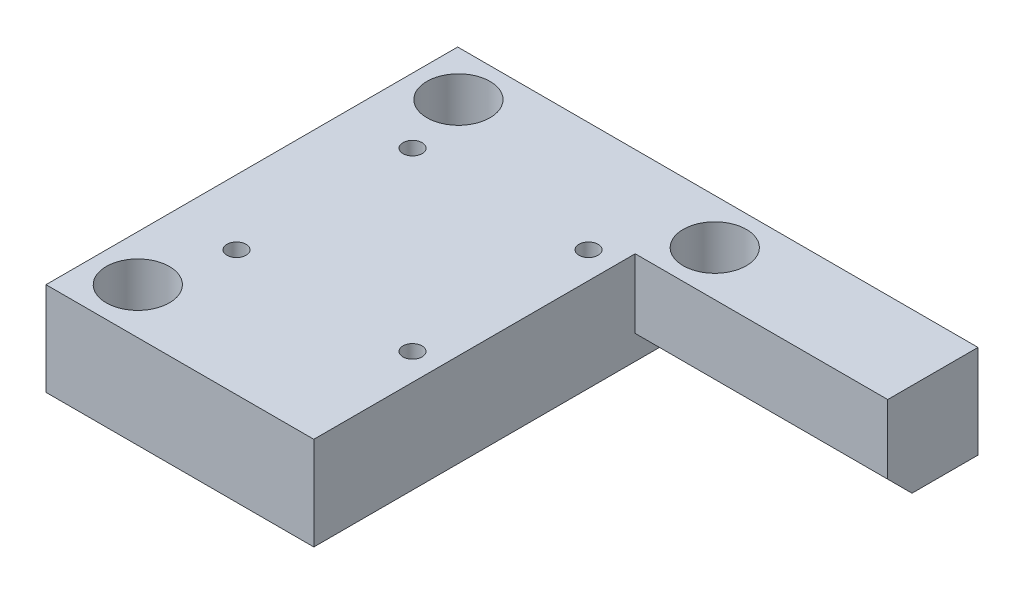
ISO-10303-21;
HEADER;
FILE_DESCRIPTION(('STEP AP214'),'2;1');
FILE_NAME('part.step','',(''),(''),'','','');
FILE_SCHEMA(('AUTOMOTIVE_DESIGN { 1 0 10303 214 1 1 1 1 }'));
ENDSEC;
DATA;
#1=APPLICATION_CONTEXT('core data for automotive mechanical design processes');
#2=APPLICATION_PROTOCOL_DEFINITION('international standard','automotive_design',2000,#1);
#3=PRODUCT_CONTEXT('',#1,'mechanical');
#4=PRODUCT('Part','Part','',(#3));
#5=PRODUCT_RELATED_PRODUCT_CATEGORY('part','',(#4));
#6=PRODUCT_DEFINITION_FORMATION('','',#4);
#7=PRODUCT_DEFINITION_CONTEXT('part definition',#1,'design');
#8=PRODUCT_DEFINITION('design','',#6,#7);
#9=PRODUCT_DEFINITION_SHAPE('','',#8);
#10=(LENGTH_UNIT() NAMED_UNIT(*) SI_UNIT(.MILLI.,.METRE.));
#11=(NAMED_UNIT(*) PLANE_ANGLE_UNIT() SI_UNIT($,.RADIAN.));
#12=(NAMED_UNIT(*) SI_UNIT($,.STERADIAN.) SOLID_ANGLE_UNIT());
#13=UNCERTAINTY_MEASURE_WITH_UNIT(LENGTH_MEASURE(1.E-05),#10,'distance_accuracy_value','');
#14=(GEOMETRIC_REPRESENTATION_CONTEXT(3) GLOBAL_UNCERTAINTY_ASSIGNED_CONTEXT((#13)) GLOBAL_UNIT_ASSIGNED_CONTEXT((#10,
#11,#12)) REPRESENTATION_CONTEXT('',''));
#15=CARTESIAN_POINT('',(0.,0.,0.));
#16=DIRECTION('',(0.,0.,1.));
#17=DIRECTION('',(1.,0.,0.));
#18=AXIS2_PLACEMENT_3D('',#15,#16,#17);
#19=CARTESIAN_POINT('',(0.,-12.192,11.8));
#20=DIRECTION('',(0.,1.,0.));
#21=DIRECTION('',(0.,0.,1.));
#22=AXIS2_PLACEMENT_3D('',#19,#20,#21);
#23=PLANE('',#22);
#24=CARTESIAN_POINT('',(6.,-12.192,47.8));
#25=DIRECTION('',(0.,1.,0.));
#26=DIRECTION('',(0.,0.,1.));
#27=AXIS2_PLACEMENT_3D('',#24,#25,#26);
#28=CIRCLE('',#27,2.25000000000002);
#29=CARTESIAN_POINT('',(6.,-12.192,50.05));
#30=VERTEX_POINT('',#29);
#31=EDGE_CURVE('E233',#30,#30,#28,.T.);
#32=ORIENTED_EDGE('',*,*,#31,.T.);
#33=EDGE_LOOP('',(#32));
#34=FACE_BOUND('',#33,.T.);
#35=CARTESIAN_POINT('',(6.,-12.192,5.90000000000001));
#36=DIRECTION('',(0.,1.,0.));
#37=DIRECTION('',(0.,0.,1.));
#38=AXIS2_PLACEMENT_3D('',#35,#36,#37);
#39=CIRCLE('',#38,2.25000000000002);
#40=CARTESIAN_POINT('',(6.,-12.192,8.15000000000003));
#41=VERTEX_POINT('',#40);
#42=EDGE_CURVE('E221',#41,#41,#39,.T.);
#43=ORIENTED_EDGE('',*,*,#42,.T.);
#44=EDGE_LOOP('',(#43));
#45=FACE_BOUND('',#44,.T.);
#46=CARTESIAN_POINT('',(39.5,-12.192,5.9));
#47=DIRECTION('',(0.,1.,0.));
#48=DIRECTION('',(0.,0.,1.));
#49=AXIS2_PLACEMENT_3D('',#46,#47,#48);
#50=CIRCLE('',#49,2.25000000000002);
#51=CARTESIAN_POINT('',(39.5,-12.192,8.15000000000002));
#52=VERTEX_POINT('',#51);
#53=EDGE_CURVE('E209',#52,#52,#50,.T.);
#54=ORIENTED_EDGE('',*,*,#53,.T.);
#55=EDGE_LOOP('',(#54));
#56=FACE_BOUND('',#55,.T.);
#57=CARTESIAN_POINT('',(31.5021834883644,-12.192,14.402424999977));
#58=DIRECTION('',(0.,-1.,0.));
#59=DIRECTION('',(0.,0.,-1.));
#60=AXIS2_PLACEMENT_3D('',#57,#58,#59);
#61=CIRCLE('',#60,1.24999999999369);
#62=CARTESIAN_POINT('',(31.5021834883644,-12.192,13.1524249999833));
#63=VERTEX_POINT('',#62);
#64=EDGE_CURVE('E206',#63,#63,#61,.T.);
#65=ORIENTED_EDGE('',*,*,#64,.F.);
#66=EDGE_LOOP('',(#65));
#67=FACE_BOUND('',#66,.T.);
#68=CARTESIAN_POINT('',(31.5000000000003,-12.192,37.4046084883411));
#69=DIRECTION('',(0.,-1.,0.));
#70=DIRECTION('',(0.,0.,-1.));
#71=AXIS2_PLACEMENT_3D('',#68,#69,#70);
#72=CIRCLE('',#71,1.24999999999369);
#73=CARTESIAN_POINT('',(31.5000000000003,-12.192,36.1546084883474));
#74=VERTEX_POINT('',#73);
#75=EDGE_CURVE('E200',#74,#74,#72,.T.);
#76=ORIENTED_EDGE('',*,*,#75,.F.);
#77=EDGE_LOOP('',(#76));
#78=FACE_BOUND('',#77,.T.);
#79=CARTESIAN_POINT('',(8.50000000000008,-12.192,14.4002415116128));
#80=DIRECTION('',(0.,-1.,0.));
#81=DIRECTION('',(0.,0.,-1.));
#82=AXIS2_PLACEMENT_3D('',#79,#80,#81);
#83=CIRCLE('',#82,1.24999999999369);
#84=CARTESIAN_POINT('',(8.50000000000008,-12.192,13.1502415116191));
#85=VERTEX_POINT('',#84);
#86=EDGE_CURVE('E188',#85,#85,#83,.T.);
#87=ORIENTED_EDGE('',*,*,#86,.F.);
#88=EDGE_LOOP('',(#87));
#89=FACE_BOUND('',#88,.T.);
#90=DIRECTION('',(0.,0.,1.));
#91=VECTOR('',#90,1.);
#92=CARTESIAN_POINT('',(68.,-12.192,11.8));
#93=LINE('',#92,#91);
#94=CARTESIAN_POINT('',(68.,-12.192,8.625));
#95=VERTEX_POINT('',#94);
#96=CARTESIAN_POINT('',(68.,-12.192,0.));
#97=VERTEX_POINT('',#96);
#98=EDGE_CURVE('E116',#95,#97,#93,.F.);
#99=ORIENTED_EDGE('',*,*,#98,.F.);
#100=DIRECTION('',(-1.,0.,0.));
#101=VECTOR('',#100,1.);
#102=CARTESIAN_POINT('',(35.,-12.192,8.625));
#103=LINE('',#102,#101);
#104=CARTESIAN_POINT('',(35.,-12.192,8.625));
#105=VERTEX_POINT('',#104);
#106=EDGE_CURVE('E47',#95,#105,#103,.T.);
#107=ORIENTED_EDGE('',*,*,#106,.T.);
#108=DIRECTION('',(0.,0.,1.));
#109=VECTOR('',#108,1.);
#110=CARTESIAN_POINT('',(35.,-12.192,11.8));
#111=LINE('',#110,#109);
#112=CARTESIAN_POINT('',(35.,-12.192,53.8));
#113=VERTEX_POINT('',#112);
#114=EDGE_CURVE('E53',#113,#105,#111,.F.);
#115=ORIENTED_EDGE('',*,*,#114,.F.);
#116=DIRECTION('',(1.,0.,0.));
#117=VECTOR('',#116,1.);
#118=CARTESIAN_POINT('',(0.,-12.192,53.8));
#119=LINE('',#118,#117);
#120=CARTESIAN_POINT('',(0.,-12.192,53.8));
#121=VERTEX_POINT('',#120);
#122=EDGE_CURVE('E111',#121,#113,#119,.T.);
#123=ORIENTED_EDGE('',*,*,#122,.F.);
#124=DIRECTION('',(0.,0.,1.));
#125=VECTOR('',#124,1.);
#126=CARTESIAN_POINT('',(0.,-12.192,11.8));
#127=LINE('',#126,#125);
#128=CARTESIAN_POINT('',(0.,-12.192,0.));
#129=VERTEX_POINT('',#128);
#130=EDGE_CURVE('E122',#129,#121,#127,.T.);
#131=ORIENTED_EDGE('',*,*,#130,.F.);
#132=DIRECTION('',(1.,0.,0.));
#133=VECTOR('',#132,1.);
#134=CARTESIAN_POINT('',(0.,-12.192,0.));
#135=LINE('',#134,#133);
#136=EDGE_CURVE('E126',#97,#129,#135,.F.);
#137=ORIENTED_EDGE('',*,*,#136,.F.);
#138=EDGE_LOOP('',(#99,#107,#115,#123,#131,#137));
#139=FACE_BOUND('',#138,.T.);
#140=CARTESIAN_POINT('',(8.497816511636,-12.192,37.4024249999771));
#141=DIRECTION('',(0.,-1.,0.));
#142=DIRECTION('',(0.,0.,-1.));
#143=AXIS2_PLACEMENT_3D('',#140,#141,#142);
#144=CIRCLE('',#143,1.24999999999369);
#145=CARTESIAN_POINT('',(8.497816511636,-12.192,36.1524249999834));
#146=VERTEX_POINT('',#145);
#147=EDGE_CURVE('E194',#146,#146,#144,.T.);
#148=ORIENTED_EDGE('',*,*,#147,.F.);
#149=EDGE_LOOP('',(#148));
#150=FACE_BOUND('',#149,.T.);
#151=ADVANCED_FACE('F39',(#34,#45,#56,#67,#78,#89,#139,#150),#23,.F.);
#152=CARTESIAN_POINT('',(0.,0.,11.8));
#153=DIRECTION('',(0.,-1.,0.));
#154=DIRECTION('',(0.,0.,-1.));
#155=AXIS2_PLACEMENT_3D('',#152,#153,#154);
#156=PLANE('',#155);
#157=CARTESIAN_POINT('',(6.,0.,47.8));
#158=DIRECTION('',(0.,1.,0.));
#159=DIRECTION('',(0.,0.,1.));
#160=AXIS2_PLACEMENT_3D('',#157,#158,#159);
#161=CIRCLE('',#160,4.125);
#162=CARTESIAN_POINT('',(6.,0.,51.925));
#163=VERTEX_POINT('',#162);
#164=EDGE_CURVE('E242',#163,#163,#161,.T.);
#165=ORIENTED_EDGE('',*,*,#164,.F.);
#166=EDGE_LOOP('',(#165));
#167=FACE_BOUND('',#166,.T.);
#168=CARTESIAN_POINT('',(6.,0.,5.90000000000001));
#169=DIRECTION('',(0.,1.,0.));
#170=DIRECTION('',(0.,0.,1.));
#171=AXIS2_PLACEMENT_3D('',#168,#169,#170);
#172=CIRCLE('',#171,4.125);
#173=CARTESIAN_POINT('',(6.,0.,10.025));
#174=VERTEX_POINT('',#173);
#175=EDGE_CURVE('E230',#174,#174,#172,.T.);
#176=ORIENTED_EDGE('',*,*,#175,.F.);
#177=EDGE_LOOP('',(#176));
#178=FACE_BOUND('',#177,.T.);
#179=CARTESIAN_POINT('',(39.5,0.,5.9));
#180=DIRECTION('',(0.,1.,0.));
#181=DIRECTION('',(0.,0.,1.));
#182=AXIS2_PLACEMENT_3D('',#179,#180,#181);
#183=CIRCLE('',#182,4.125);
#184=CARTESIAN_POINT('',(39.5,0.,10.025));
#185=VERTEX_POINT('',#184);
#186=EDGE_CURVE('E218',#185,#185,#183,.T.);
#187=ORIENTED_EDGE('',*,*,#186,.F.);
#188=EDGE_LOOP('',(#187));
#189=FACE_BOUND('',#188,.T.);
#190=CARTESIAN_POINT('',(31.5021834883644,0.,14.402424999977));
#191=DIRECTION('',(0.,-1.,0.));
#192=DIRECTION('',(0.,0.,-1.));
#193=AXIS2_PLACEMENT_3D('',#190,#191,#192);
#194=CIRCLE('',#193,1.24999999999369);
#195=CARTESIAN_POINT('',(31.5021834883644,0.,13.1524249999833));
#196=VERTEX_POINT('',#195);
#197=EDGE_CURVE('E203',#196,#196,#194,.T.);
#198=ORIENTED_EDGE('',*,*,#197,.T.);
#199=EDGE_LOOP('',(#198));
#200=FACE_BOUND('',#199,.T.);
#201=CARTESIAN_POINT('',(31.5000000000003,0.,37.4046084883411));
#202=DIRECTION('',(0.,-1.,0.));
#203=DIRECTION('',(0.,0.,-1.));
#204=AXIS2_PLACEMENT_3D('',#201,#202,#203);
#205=CIRCLE('',#204,1.24999999999369);
#206=CARTESIAN_POINT('',(31.5000000000003,0.,36.1546084883474));
#207=VERTEX_POINT('',#206);
#208=EDGE_CURVE('E197',#207,#207,#205,.T.);
#209=ORIENTED_EDGE('',*,*,#208,.T.);
#210=EDGE_LOOP('',(#209));
#211=FACE_BOUND('',#210,.T.);
#212=CARTESIAN_POINT('',(8.497816511636,0.,37.4024249999771));
#213=DIRECTION('',(0.,-1.,0.));
#214=DIRECTION('',(0.,0.,-1.));
#215=AXIS2_PLACEMENT_3D('',#212,#213,#214);
#216=CIRCLE('',#215,1.24999999999369);
#217=CARTESIAN_POINT('',(8.497816511636,0.,36.1524249999834));
#218=VERTEX_POINT('',#217);
#219=EDGE_CURVE('E191',#218,#218,#216,.T.);
#220=ORIENTED_EDGE('',*,*,#219,.T.);
#221=EDGE_LOOP('',(#220));
#222=FACE_BOUND('',#221,.T.);
#223=CARTESIAN_POINT('',(8.50000000000008,0.,14.4002415116128));
#224=DIRECTION('',(0.,-1.,0.));
#225=DIRECTION('',(0.,0.,-1.));
#226=AXIS2_PLACEMENT_3D('',#223,#224,#225);
#227=CIRCLE('',#226,1.24999999999369);
#228=CARTESIAN_POINT('',(8.50000000000008,0.,13.1502415116191));
#229=VERTEX_POINT('',#228);
#230=EDGE_CURVE('E173',#229,#229,#227,.T.);
#231=ORIENTED_EDGE('',*,*,#230,.T.);
#232=EDGE_LOOP('',(#231));
#233=FACE_BOUND('',#232,.T.);
#234=DIRECTION('',(0.,0.,1.));
#235=VECTOR('',#234,1.);
#236=CARTESIAN_POINT('',(0.,0.,11.8));
#237=LINE('',#236,#235);
#238=CARTESIAN_POINT('',(0.,0.,0.));
#239=VERTEX_POINT('',#238);
#240=CARTESIAN_POINT('',(0.,0.,53.8));
#241=VERTEX_POINT('',#240);
#242=EDGE_CURVE('E159',#239,#241,#237,.T.);
#243=ORIENTED_EDGE('',*,*,#242,.T.);
#244=DIRECTION('',(1.,0.,0.));
#245=VECTOR('',#244,1.);
#246=CARTESIAN_POINT('',(0.,0.,53.8));
#247=LINE('',#246,#245);
#248=CARTESIAN_POINT('',(35.,0.,53.8));
#249=VERTEX_POINT('',#248);
#250=EDGE_CURVE('E105',#249,#241,#247,.F.);
#251=ORIENTED_EDGE('',*,*,#250,.F.);
#252=DIRECTION('',(0.,0.,1.));
#253=VECTOR('',#252,1.);
#254=CARTESIAN_POINT('',(35.,0.,53.8));
#255=LINE('',#254,#253);
#256=CARTESIAN_POINT('',(35.,0.,11.8));
#257=VERTEX_POINT('',#256);
#258=EDGE_CURVE('E100',#249,#257,#255,.F.);
#259=ORIENTED_EDGE('',*,*,#258,.T.);
#260=DIRECTION('',(1.,0.,0.));
#261=VECTOR('',#260,1.);
#262=CARTESIAN_POINT('',(0.,0.,11.8));
#263=LINE('',#262,#261);
#264=CARTESIAN_POINT('',(68.,0.,11.8));
#265=VERTEX_POINT('',#264);
#266=EDGE_CURVE('E170',#265,#257,#263,.F.);
#267=ORIENTED_EDGE('',*,*,#266,.F.);
#268=DIRECTION('',(0.,0.,1.));
#269=VECTOR('',#268,1.);
#270=CARTESIAN_POINT('',(68.,0.,11.8));
#271=LINE('',#270,#269);
#272=CARTESIAN_POINT('',(68.,0.,0.));
#273=VERTEX_POINT('',#272);
#274=EDGE_CURVE('E292',#265,#273,#271,.F.);
#275=ORIENTED_EDGE('',*,*,#274,.T.);
#276=DIRECTION('',(1.,0.,0.));
#277=VECTOR('',#276,1.);
#278=CARTESIAN_POINT('',(0.,0.,0.));
#279=LINE('',#278,#277);
#280=EDGE_CURVE('E165',#273,#239,#279,.F.);
#281=ORIENTED_EDGE('',*,*,#280,.T.);
#282=EDGE_LOOP('',(#243,#251,#259,#267,#275,#281));
#283=FACE_BOUND('',#282,.T.);
#284=ADVANCED_FACE('F248',(#167,#178,#189,#200,#211,#222,#233,#283),#156,.F.);
#285=CARTESIAN_POINT('',(0.,0.,11.8));
#286=DIRECTION('',(0.,0.,1.));
#287=DIRECTION('',(1.,0.,0.));
#288=AXIS2_PLACEMENT_3D('',#285,#286,#287);
#289=PLANE('',#288);
#290=DIRECTION('',(0.,1.,0.));
#291=VECTOR('',#290,1.);
#292=CARTESIAN_POINT('',(35.,0.,11.8));
#293=LINE('',#292,#291);
#294=CARTESIAN_POINT('',(35.,-9.01700000000001,11.8));
#295=VERTEX_POINT('',#294);
#296=EDGE_CURVE('E294',#257,#295,#293,.F.);
#297=ORIENTED_EDGE('',*,*,#296,.T.);
#298=DIRECTION('',(1.,0.,0.));
#299=VECTOR('',#298,1.);
#300=CARTESIAN_POINT('',(68.,-9.01700000000001,11.8));
#301=LINE('',#300,#299);
#302=CARTESIAN_POINT('',(68.,-9.01700000000001,11.8));
#303=VERTEX_POINT('',#302);
#304=EDGE_CURVE('E174',#295,#303,#301,.T.);
#305=ORIENTED_EDGE('',*,*,#304,.T.);
#306=DIRECTION('',(0.,1.,0.));
#307=VECTOR('',#306,1.);
#308=CARTESIAN_POINT('',(68.,0.,11.8));
#309=LINE('',#308,#307);
#310=EDGE_CURVE('E278',#303,#265,#309,.T.);
#311=ORIENTED_EDGE('',*,*,#310,.T.);
#312=ORIENTED_EDGE('',*,*,#266,.T.);
#313=EDGE_LOOP('',(#297,#305,#311,#312));
#314=FACE_BOUND('',#313,.T.);
#315=ADVANCED_FACE('F251',(#314),#289,.T.);
#316=CARTESIAN_POINT('',(0.,0.,0.));
#317=DIRECTION('',(0.,0.,1.));
#318=DIRECTION('',(1.,0.,0.));
#319=AXIS2_PLACEMENT_3D('',#316,#317,#318);
#320=PLANE('',#319);
#321=ORIENTED_EDGE('',*,*,#280,.F.);
#322=DIRECTION('',(0.,1.,0.));
#323=VECTOR('',#322,1.);
#324=CARTESIAN_POINT('',(68.,0.,0.));
#325=LINE('',#324,#323);
#326=EDGE_CURVE('E281',#273,#97,#325,.F.);
#327=ORIENTED_EDGE('',*,*,#326,.T.);
#328=ORIENTED_EDGE('',*,*,#136,.T.);
#329=DIRECTION('',(0.,1.,0.));
#330=VECTOR('',#329,1.);
#331=CARTESIAN_POINT('',(0.,0.,0.));
#332=LINE('',#331,#330);
#333=EDGE_CURVE('E164',#129,#239,#332,.T.);
#334=ORIENTED_EDGE('',*,*,#333,.T.);
#335=EDGE_LOOP('',(#321,#327,#328,#334));
#336=FACE_BOUND('',#335,.T.);
#337=ADVANCED_FACE('F331',(#336),#320,.F.);
#338=CARTESIAN_POINT('',(0.,0.,11.8));
#339=DIRECTION('',(1.,0.,0.));
#340=DIRECTION('',(0.,1.,0.));
#341=AXIS2_PLACEMENT_3D('',#338,#339,#340);
#342=PLANE('',#341);
#343=ORIENTED_EDGE('',*,*,#130,.T.);
#344=DIRECTION('',(0.,1.,0.));
#345=VECTOR('',#344,1.);
#346=CARTESIAN_POINT('',(0.,0.,53.8));
#347=LINE('',#346,#345);
#348=EDGE_CURVE('E120',#241,#121,#347,.F.);
#349=ORIENTED_EDGE('',*,*,#348,.F.);
#350=ORIENTED_EDGE('',*,*,#242,.F.);
#351=ORIENTED_EDGE('',*,*,#333,.F.);
#352=EDGE_LOOP('',(#343,#349,#350,#351));
#353=FACE_BOUND('',#352,.T.);
#354=ADVANCED_FACE('F270',(#353),#342,.F.);
#355=CARTESIAN_POINT('',(0.,0.,53.8));
#356=DIRECTION('',(0.,0.,1.));
#357=DIRECTION('',(1.,0.,0.));
#358=AXIS2_PLACEMENT_3D('',#355,#356,#357);
#359=PLANE('',#358);
#360=DIRECTION('',(0.,1.,0.));
#361=VECTOR('',#360,1.);
#362=CARTESIAN_POINT('',(35.,0.,53.8));
#363=LINE('',#362,#361);
#364=EDGE_CURVE('E96',#113,#249,#363,.T.);
#365=ORIENTED_EDGE('',*,*,#364,.T.);
#366=ORIENTED_EDGE('',*,*,#250,.T.);
#367=ORIENTED_EDGE('',*,*,#348,.T.);
#368=ORIENTED_EDGE('',*,*,#122,.T.);
#369=EDGE_LOOP('',(#365,#366,#367,#368));
#370=FACE_BOUND('',#369,.T.);
#371=ADVANCED_FACE('F118',(#370),#359,.T.);
#372=CARTESIAN_POINT('',(35.,0.,53.8));
#373=DIRECTION('',(-1.,0.,0.));
#374=DIRECTION('',(0.,0.,1.));
#375=AXIS2_PLACEMENT_3D('',#372,#373,#374);
#376=PLANE('',#375);
#377=ORIENTED_EDGE('',*,*,#114,.T.);
#378=DIRECTION('',(0.,0.707106781186546,0.707106781186549));
#379=VECTOR('',#378,1.);
#380=CARTESIAN_POINT('',(35.,16.4915,37.3085000000001));
#381=LINE('',#380,#379);
#382=EDGE_CURVE('E12',#105,#295,#381,.T.);
#383=ORIENTED_EDGE('',*,*,#382,.T.);
#384=ORIENTED_EDGE('',*,*,#296,.F.);
#385=ORIENTED_EDGE('',*,*,#258,.F.);
#386=ORIENTED_EDGE('',*,*,#364,.F.);
#387=EDGE_LOOP('',(#377,#383,#384,#385,#386));
#388=FACE_BOUND('',#387,.T.);
#389=ADVANCED_FACE('F97',(#388),#376,.F.);
#390=CARTESIAN_POINT('',(68.,0.,11.8));
#391=DIRECTION('',(-1.,0.,0.));
#392=DIRECTION('',(0.,0.,1.));
#393=AXIS2_PLACEMENT_3D('',#390,#391,#392);
#394=PLANE('',#393);
#395=ORIENTED_EDGE('',*,*,#310,.F.);
#396=DIRECTION('',(0.,-0.707106781186546,-0.707106781186549));
#397=VECTOR('',#396,1.);
#398=CARTESIAN_POINT('',(68.,-9.01700000000001,11.8));
#399=LINE('',#398,#397);
#400=EDGE_CURVE('E61',#303,#95,#399,.T.);
#401=ORIENTED_EDGE('',*,*,#400,.T.);
#402=ORIENTED_EDGE('',*,*,#98,.T.);
#403=ORIENTED_EDGE('',*,*,#326,.F.);
#404=ORIENTED_EDGE('',*,*,#274,.F.);
#405=EDGE_LOOP('',(#395,#401,#402,#403,#404));
#406=FACE_BOUND('',#405,.T.);
#407=ADVANCED_FACE('F312',(#406),#394,.F.);
#408=CARTESIAN_POINT('',(8.50000000000008,-12.192,14.4002415116128));
#409=DIRECTION('',(0.,-1.,0.));
#410=DIRECTION('',(0.,0.,-1.));
#411=AXIS2_PLACEMENT_3D('',#408,#409,#410);
#412=CYLINDRICAL_SURFACE('',#411,1.24999999999369);
#413=ORIENTED_EDGE('',*,*,#230,.F.);
#414=EDGE_LOOP('',(#413));
#415=FACE_BOUND('',#414,.T.);
#416=ORIENTED_EDGE('',*,*,#86,.T.);
#417=EDGE_LOOP('',(#416));
#418=FACE_BOUND('',#417,.T.);
#419=ADVANCED_FACE('F252',(#415,#418),#412,.F.);
#420=CARTESIAN_POINT('',(8.497816511636,-12.192,37.4024249999771));
#421=DIRECTION('',(0.,-1.,0.));
#422=DIRECTION('',(0.,0.,-1.));
#423=AXIS2_PLACEMENT_3D('',#420,#421,#422);
#424=CYLINDRICAL_SURFACE('',#423,1.24999999999369);
#425=ORIENTED_EDGE('',*,*,#219,.F.);
#426=EDGE_LOOP('',(#425));
#427=FACE_BOUND('',#426,.T.);
#428=ORIENTED_EDGE('',*,*,#147,.T.);
#429=EDGE_LOOP('',(#428));
#430=FACE_BOUND('',#429,.T.);
#431=ADVANCED_FACE('F323',(#427,#430),#424,.F.);
#432=CARTESIAN_POINT('',(31.5000000000003,-12.192,37.4046084883411));
#433=DIRECTION('',(0.,-1.,0.));
#434=DIRECTION('',(0.,0.,-1.));
#435=AXIS2_PLACEMENT_3D('',#432,#433,#434);
#436=CYLINDRICAL_SURFACE('',#435,1.24999999999369);
#437=ORIENTED_EDGE('',*,*,#208,.F.);
#438=EDGE_LOOP('',(#437));
#439=FACE_BOUND('',#438,.T.);
#440=ORIENTED_EDGE('',*,*,#75,.T.);
#441=EDGE_LOOP('',(#440));
#442=FACE_BOUND('',#441,.T.);
#443=ADVANCED_FACE('F454',(#439,#442),#436,.F.);
#444=CARTESIAN_POINT('',(31.5021834883644,-12.192,14.402424999977));
#445=DIRECTION('',(0.,-1.,0.));
#446=DIRECTION('',(0.,0.,-1.));
#447=AXIS2_PLACEMENT_3D('',#444,#445,#446);
#448=CYLINDRICAL_SURFACE('',#447,1.24999999999369);
#449=ORIENTED_EDGE('',*,*,#197,.F.);
#450=EDGE_LOOP('',(#449));
#451=FACE_BOUND('',#450,.T.);
#452=ORIENTED_EDGE('',*,*,#64,.T.);
#453=EDGE_LOOP('',(#452));
#454=FACE_BOUND('',#453,.T.);
#455=ADVANCED_FACE('F445',(#451,#454),#448,.F.);
#456=CARTESIAN_POINT('',(39.5,0.,5.9));
#457=DIRECTION('',(0.,1.,0.));
#458=DIRECTION('',(0.,0.,1.));
#459=AXIS2_PLACEMENT_3D('',#456,#457,#458);
#460=CYLINDRICAL_SURFACE('',#459,2.25000000000002);
#461=ORIENTED_EDGE('',*,*,#53,.F.);
#462=EDGE_LOOP('',(#461));
#463=FACE_BOUND('',#462,.T.);
#464=CARTESIAN_POINT('',(39.5,-7.,5.9));
#465=DIRECTION('',(0.,1.,0.));
#466=DIRECTION('',(0.,0.,1.));
#467=AXIS2_PLACEMENT_3D('',#464,#465,#466);
#468=CIRCLE('',#467,2.25000000000002);
#469=CARTESIAN_POINT('',(39.5,-7.,8.15000000000003));
#470=VERTEX_POINT('',#469);
#471=EDGE_CURVE('E212',#470,#470,#468,.T.);
#472=ORIENTED_EDGE('',*,*,#471,.T.);
#473=EDGE_LOOP('',(#472));
#474=FACE_BOUND('',#473,.T.);
#475=ADVANCED_FACE('F436',(#463,#474),#460,.F.);
#476=CARTESIAN_POINT('',(41.75,-7.,5.9));
#477=DIRECTION('',(0.,-1.,0.));
#478=DIRECTION('',(0.,0.,-1.));
#479=AXIS2_PLACEMENT_3D('',#476,#477,#478);
#480=PLANE('',#479);
#481=ORIENTED_EDGE('',*,*,#471,.F.);
#482=EDGE_LOOP('',(#481));
#483=FACE_BOUND('',#482,.T.);
#484=CARTESIAN_POINT('',(39.5,-7.,5.9));
#485=DIRECTION('',(0.,1.,0.));
#486=DIRECTION('',(0.,0.,1.));
#487=AXIS2_PLACEMENT_3D('',#484,#485,#486);
#488=CIRCLE('',#487,4.125);
#489=CARTESIAN_POINT('',(39.5,-7.,10.025));
#490=VERTEX_POINT('',#489);
#491=EDGE_CURVE('E215',#490,#490,#488,.T.);
#492=ORIENTED_EDGE('',*,*,#491,.T.);
#493=EDGE_LOOP('',(#492));
#494=FACE_BOUND('',#493,.T.);
#495=ADVANCED_FACE('F427',(#483,#494),#480,.F.);
#496=CARTESIAN_POINT('',(39.5,0.,5.9));
#497=DIRECTION('',(0.,1.,0.));
#498=DIRECTION('',(0.,0.,1.));
#499=AXIS2_PLACEMENT_3D('',#496,#497,#498);
#500=CYLINDRICAL_SURFACE('',#499,4.125);
#501=ORIENTED_EDGE('',*,*,#491,.F.);
#502=EDGE_LOOP('',(#501));
#503=FACE_BOUND('',#502,.T.);
#504=ORIENTED_EDGE('',*,*,#186,.T.);
#505=EDGE_LOOP('',(#504));
#506=FACE_BOUND('',#505,.T.);
#507=ADVANCED_FACE('F418',(#503,#506),#500,.F.);
#508=CARTESIAN_POINT('',(6.,0.,5.90000000000001));
#509=DIRECTION('',(0.,1.,0.));
#510=DIRECTION('',(0.,0.,1.));
#511=AXIS2_PLACEMENT_3D('',#508,#509,#510);
#512=CYLINDRICAL_SURFACE('',#511,2.25000000000002);
#513=ORIENTED_EDGE('',*,*,#42,.F.);
#514=EDGE_LOOP('',(#513));
#515=FACE_BOUND('',#514,.T.);
#516=CARTESIAN_POINT('',(6.,-7.,5.90000000000001));
#517=DIRECTION('',(0.,1.,0.));
#518=DIRECTION('',(0.,0.,1.));
#519=AXIS2_PLACEMENT_3D('',#516,#517,#518);
#520=CIRCLE('',#519,2.25000000000002);
#521=CARTESIAN_POINT('',(6.,-7.,8.15000000000003));
#522=VERTEX_POINT('',#521);
#523=EDGE_CURVE('E224',#522,#522,#520,.T.);
#524=ORIENTED_EDGE('',*,*,#523,.T.);
#525=EDGE_LOOP('',(#524));
#526=FACE_BOUND('',#525,.T.);
#527=ADVANCED_FACE('F409',(#515,#526),#512,.F.);
#528=CARTESIAN_POINT('',(8.25000000000002,-7.,5.90000000000001));
#529=DIRECTION('',(0.,-1.,0.));
#530=DIRECTION('',(0.,0.,-1.));
#531=AXIS2_PLACEMENT_3D('',#528,#529,#530);
#532=PLANE('',#531);
#533=ORIENTED_EDGE('',*,*,#523,.F.);
#534=EDGE_LOOP('',(#533));
#535=FACE_BOUND('',#534,.T.);
#536=CARTESIAN_POINT('',(6.,-7.,5.90000000000001));
#537=DIRECTION('',(0.,1.,0.));
#538=DIRECTION('',(0.,0.,1.));
#539=AXIS2_PLACEMENT_3D('',#536,#537,#538);
#540=CIRCLE('',#539,4.125);
#541=CARTESIAN_POINT('',(6.,-7.,10.025));
#542=VERTEX_POINT('',#541);
#543=EDGE_CURVE('E227',#542,#542,#540,.T.);
#544=ORIENTED_EDGE('',*,*,#543,.T.);
#545=EDGE_LOOP('',(#544));
#546=FACE_BOUND('',#545,.T.);
#547=ADVANCED_FACE('F400',(#535,#546),#532,.F.);
#548=CARTESIAN_POINT('',(6.,0.,5.90000000000001));
#549=DIRECTION('',(0.,1.,0.));
#550=DIRECTION('',(0.,0.,1.));
#551=AXIS2_PLACEMENT_3D('',#548,#549,#550);
#552=CYLINDRICAL_SURFACE('',#551,4.125);
#553=ORIENTED_EDGE('',*,*,#543,.F.);
#554=EDGE_LOOP('',(#553));
#555=FACE_BOUND('',#554,.T.);
#556=ORIENTED_EDGE('',*,*,#175,.T.);
#557=EDGE_LOOP('',(#556));
#558=FACE_BOUND('',#557,.T.);
#559=ADVANCED_FACE('F391',(#555,#558),#552,.F.);
#560=CARTESIAN_POINT('',(6.,0.,47.8));
#561=DIRECTION('',(0.,1.,0.));
#562=DIRECTION('',(0.,0.,1.));
#563=AXIS2_PLACEMENT_3D('',#560,#561,#562);
#564=CYLINDRICAL_SURFACE('',#563,2.25000000000002);
#565=ORIENTED_EDGE('',*,*,#31,.F.);
#566=EDGE_LOOP('',(#565));
#567=FACE_BOUND('',#566,.T.);
#568=CARTESIAN_POINT('',(6.,-7.,47.8));
#569=DIRECTION('',(0.,1.,0.));
#570=DIRECTION('',(0.,0.,1.));
#571=AXIS2_PLACEMENT_3D('',#568,#569,#570);
#572=CIRCLE('',#571,2.25000000000002);
#573=CARTESIAN_POINT('',(6.,-7.,50.05));
#574=VERTEX_POINT('',#573);
#575=EDGE_CURVE('E236',#574,#574,#572,.T.);
#576=ORIENTED_EDGE('',*,*,#575,.T.);
#577=EDGE_LOOP('',(#576));
#578=FACE_BOUND('',#577,.T.);
#579=ADVANCED_FACE('F382',(#567,#578),#564,.F.);
#580=CARTESIAN_POINT('',(8.25000000000002,-7.,47.8));
#581=DIRECTION('',(0.,-1.,0.));
#582=DIRECTION('',(0.,0.,-1.));
#583=AXIS2_PLACEMENT_3D('',#580,#581,#582);
#584=PLANE('',#583);
#585=ORIENTED_EDGE('',*,*,#575,.F.);
#586=EDGE_LOOP('',(#585));
#587=FACE_BOUND('',#586,.T.);
#588=CARTESIAN_POINT('',(6.,-7.,47.8));
#589=DIRECTION('',(0.,1.,0.));
#590=DIRECTION('',(0.,0.,1.));
#591=AXIS2_PLACEMENT_3D('',#588,#589,#590);
#592=CIRCLE('',#591,4.125);
#593=CARTESIAN_POINT('',(6.,-7.,51.925));
#594=VERTEX_POINT('',#593);
#595=EDGE_CURVE('E239',#594,#594,#592,.T.);
#596=ORIENTED_EDGE('',*,*,#595,.T.);
#597=EDGE_LOOP('',(#596));
#598=FACE_BOUND('',#597,.T.);
#599=ADVANCED_FACE('F306',(#587,#598),#584,.F.);
#600=CARTESIAN_POINT('',(6.,0.,47.8));
#601=DIRECTION('',(0.,1.,0.));
#602=DIRECTION('',(0.,0.,1.));
#603=AXIS2_PLACEMENT_3D('',#600,#601,#602);
#604=CYLINDRICAL_SURFACE('',#603,4.125);
#605=ORIENTED_EDGE('',*,*,#595,.F.);
#606=EDGE_LOOP('',(#605));
#607=FACE_BOUND('',#606,.T.);
#608=ORIENTED_EDGE('',*,*,#164,.T.);
#609=EDGE_LOOP('',(#608));
#610=FACE_BOUND('',#609,.T.);
#611=ADVANCED_FACE('F246',(#607,#610),#604,.F.);
#612=CARTESIAN_POINT('',(0.,-9.01700000000001,11.8));
#613=DIRECTION('',(0.,-0.707106781186549,0.707106781186546));
#614=DIRECTION('',(-1.,0.,0.));
#615=AXIS2_PLACEMENT_3D('',#612,#613,#614);
#616=PLANE('',#615);
#617=ORIENTED_EDGE('',*,*,#382,.F.);
#618=ORIENTED_EDGE('',*,*,#106,.F.);
#619=ORIENTED_EDGE('',*,*,#400,.F.);
#620=ORIENTED_EDGE('',*,*,#304,.F.);
#621=EDGE_LOOP('',(#617,#618,#619,#620));
#622=FACE_BOUND('',#621,.T.);
#623=ADVANCED_FACE('F41',(#622),#616,.T.);
#624=CLOSED_SHELL('',(#151,#284,#315,#337,#354,#371,#389,#407,#419,#431,#443,#455,#475,#495,
#507,#527,#547,#559,#579,#599,#611,#623));
#625=MANIFOLD_SOLID_BREP('B2',#624);
#626=ADVANCED_BREP_SHAPE_REPRESENTATION('',(#18,#625),#14);
#627=SHAPE_DEFINITION_REPRESENTATION(#9,#626);
ENDSEC;
END-ISO-10303-21;
